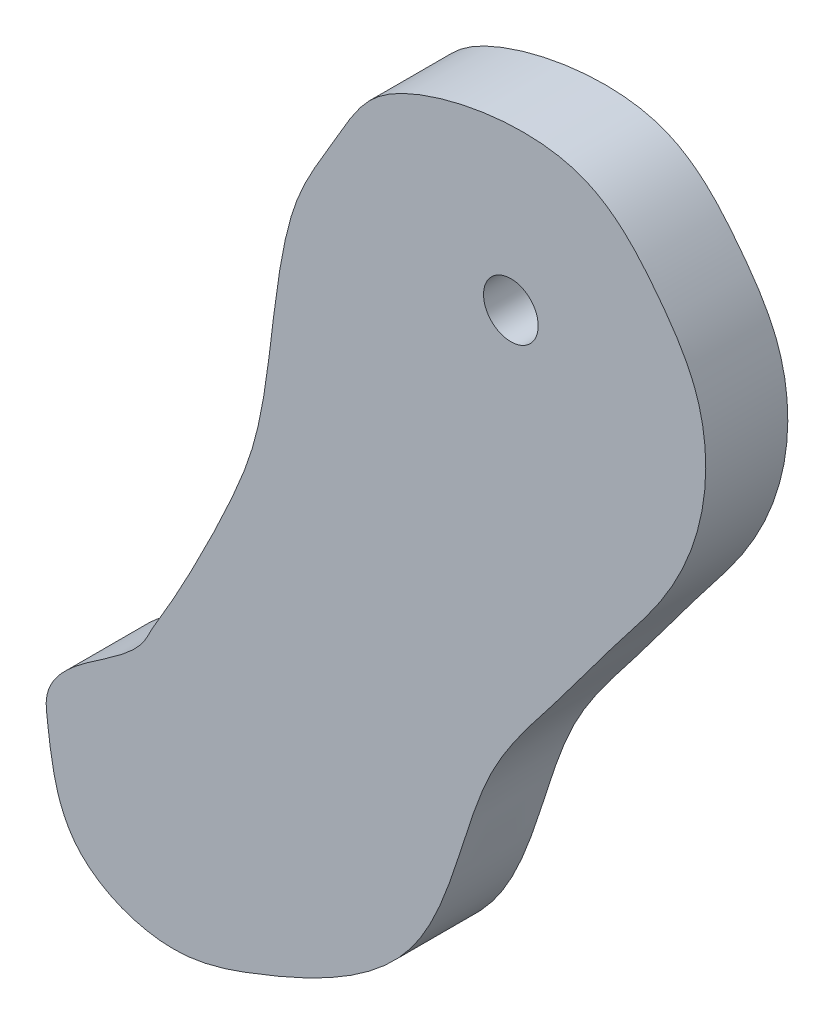
ISO-10303-21;
HEADER;
FILE_DESCRIPTION(('STEP AP214'),'2;1');
FILE_NAME('part.step','',(''),(''),'','','');
FILE_SCHEMA(('AUTOMOTIVE_DESIGN { 1 0 10303 214 1 1 1 1 }'));
ENDSEC;
DATA;
#1=APPLICATION_CONTEXT('core data for automotive mechanical design processes');
#2=APPLICATION_PROTOCOL_DEFINITION('international standard','automotive_design',2000,#1);
#3=PRODUCT_CONTEXT('',#1,'mechanical');
#4=PRODUCT('Part','Part','',(#3));
#5=PRODUCT_RELATED_PRODUCT_CATEGORY('part','',(#4));
#6=PRODUCT_DEFINITION_FORMATION('','',#4);
#7=PRODUCT_DEFINITION_CONTEXT('part definition',#1,'design');
#8=PRODUCT_DEFINITION('design','',#6,#7);
#9=PRODUCT_DEFINITION_SHAPE('','',#8);
#10=(LENGTH_UNIT() NAMED_UNIT(*) SI_UNIT(.MILLI.,.METRE.));
#11=(NAMED_UNIT(*) PLANE_ANGLE_UNIT() SI_UNIT($,.RADIAN.));
#12=(NAMED_UNIT(*) SI_UNIT($,.STERADIAN.) SOLID_ANGLE_UNIT());
#13=UNCERTAINTY_MEASURE_WITH_UNIT(LENGTH_MEASURE(1.E-05),#10,'distance_accuracy_value','');
#14=(GEOMETRIC_REPRESENTATION_CONTEXT(3) GLOBAL_UNCERTAINTY_ASSIGNED_CONTEXT((#13)) GLOBAL_UNIT_ASSIGNED_CONTEXT((#10,
#11,#12)) REPRESENTATION_CONTEXT('',''));
#15=CARTESIAN_POINT('',(0.,0.,0.));
#16=DIRECTION('',(0.,0.,1.));
#17=DIRECTION('',(1.,0.,0.));
#18=AXIS2_PLACEMENT_3D('',#15,#16,#17);
#19=CARTESIAN_POINT('',(-13.9187579635498,-4.98327703315374,3.));
#20=CARTESIAN_POINT('',(-13.8913839542716,-3.85610857471606,3.));
#21=CARTESIAN_POINT('',(-10.5195286882443,-1.84720762742832,3.));
#22=CARTESIAN_POINT('',(-10.1595241499511,-0.739910558036557,3.));
#23=CARTESIAN_POINT('',(-9.27298416828187,0.450357546495944,3.));
#24=CARTESIAN_POINT('',(-6.60460595874179,5.86872059642833,3.));
#25=CARTESIAN_POINT('',(-5.86434099670478,8.43527780771908,3.));
#26=CARTESIAN_POINT('',(-5.26305396048236,14.9937334901543,3.));
#27=CARTESIAN_POINT('',(-2.88813848215597,18.8302397059523,3.));
#28=CARTESIAN_POINT('',(-1.95605752544011,21.0713879921337,3.));
#29=CARTESIAN_POINT('',(5.39292609840897,22.6268629511655,3.));
#30=CARTESIAN_POINT('',(8.27010881393388,19.4445422402987,3.));
#31=CARTESIAN_POINT('',(10.1887589331951,16.6288293820978,3.));
#32=CARTESIAN_POINT('',(10.3460989172217,13.0123883856087,3.));
#33=CARTESIAN_POINT('',(8.93698439335931,9.78869835523108,3.));
#34=CARTESIAN_POINT('',(6.75344503672636,7.13072751511924,3.));
#35=CARTESIAN_POINT('',(4.74899392645413,4.31130847135723,3.));
#36=CARTESIAN_POINT('',(2.04591962898475,1.08453649628744,3.));
#37=CARTESIAN_POINT('',(1.13601821784208,-2.79384029872061,3.));
#38=CARTESIAN_POINT('',(-0.883041283386666,-7.3396050476453,3.));
#39=CARTESIAN_POINT('',(-5.11326568406489,-9.39072479428553,3.));
#40=CARTESIAN_POINT('',(-9.48272686637992,-10.8852616054775,3.));
#41=CARTESIAN_POINT('',(-13.4150806657355,-9.3477618856312,3.));
#42=CARTESIAN_POINT('',(-13.7549527056015,-6.54607838011544,3.));
#43=CARTESIAN_POINT('',(-13.9221054390931,-5.1211146735764,3.));
#44=CARTESIAN_POINT('',(-13.9187579635498,-4.98327703315374,3.));
#45=B_SPLINE_CURVE_WITH_KNOTS('',3,(#19,#20,#21,#22,#23,#24,#25,#26,#27,#28,#29,#30,#31,#32,#33,
#34,#35,#36,#37,#38,#39,#40,#41,#42,#43,#44),.UNSPECIFIED.,.T.,.F.,(4,1,1,1,1,1,1,1,1,1,1,1,1,1,
1,1,1,1,1,1,1,1,1,4),(0.,0.0388920203203432,0.0957910713786864,0.170637324850251,
0.206387983363971,0.248875394756016,0.278358672407214,0.297921345713307,0.348786261929981,
0.419462087152307,0.462880556637251,0.494962177423828,0.536060755971546,0.581869624844249,
0.614364109209545,0.655354426578634,0.702626505741707,0.758040334594742,0.792049077363629,
0.87188756118118,0.908934810693921,0.952440256182676,0.995244025618268,1.),.UNSPECIFIED.);
#46=DIRECTION('',(0.,0.,-1.));
#47=VECTOR('',#46,1.);
#48=SURFACE_OF_LINEAR_EXTRUSION('',#45,#47);
#49=CARTESIAN_POINT('',(-13.9187579635498,-4.98327703315374,3.));
#50=VERTEX_POINT('',#49);
#51=EDGE_CURVE('E45',#50,#50,#45,.T.);
#52=ORIENTED_EDGE('',*,*,#51,.T.);
#53=EDGE_LOOP('',(#52));
#54=FACE_BOUND('',#53,.T.);
#55=CARTESIAN_POINT('',(-13.9187579635498,-4.98327703315374,0.));
#56=CARTESIAN_POINT('',(-13.8913839542716,-3.85610857471606,0.));
#57=CARTESIAN_POINT('',(-10.5195286882443,-1.84720762742832,0.));
#58=CARTESIAN_POINT('',(-10.1595241499511,-0.739910558036557,0.));
#59=CARTESIAN_POINT('',(-9.27298416828187,0.450357546495944,0.));
#60=CARTESIAN_POINT('',(-6.60460595874179,5.86872059642833,0.));
#61=CARTESIAN_POINT('',(-5.86434099670478,8.43527780771908,0.));
#62=CARTESIAN_POINT('',(-5.26305396048236,14.9937334901543,0.));
#63=CARTESIAN_POINT('',(-2.88813848215597,18.8302397059523,0.));
#64=CARTESIAN_POINT('',(-1.95605752544011,21.0713879921337,0.));
#65=CARTESIAN_POINT('',(5.39292609840897,22.6268629511655,0.));
#66=CARTESIAN_POINT('',(8.27010881393388,19.4445422402987,0.));
#67=CARTESIAN_POINT('',(10.1887589331951,16.6288293820978,0.));
#68=CARTESIAN_POINT('',(10.3460989172217,13.0123883856087,0.));
#69=CARTESIAN_POINT('',(8.93698439335931,9.78869835523108,0.));
#70=CARTESIAN_POINT('',(6.75344503672636,7.13072751511924,0.));
#71=CARTESIAN_POINT('',(4.74899392645413,4.31130847135723,0.));
#72=CARTESIAN_POINT('',(2.04591962898475,1.08453649628744,0.));
#73=CARTESIAN_POINT('',(1.13601821784208,-2.79384029872061,0.));
#74=CARTESIAN_POINT('',(-0.883041283386666,-7.3396050476453,0.));
#75=CARTESIAN_POINT('',(-5.11326568406489,-9.39072479428553,0.));
#76=CARTESIAN_POINT('',(-9.48272686637992,-10.8852616054775,0.));
#77=CARTESIAN_POINT('',(-13.4150806657355,-9.3477618856312,0.));
#78=CARTESIAN_POINT('',(-13.7549527056015,-6.54607838011544,0.));
#79=CARTESIAN_POINT('',(-13.9221054390931,-5.1211146735764,0.));
#80=CARTESIAN_POINT('',(-13.9187579635498,-4.98327703315374,0.));
#81=B_SPLINE_CURVE_WITH_KNOTS('',3,(#55,#56,#57,#58,#59,#60,#61,#62,#63,#64,#65,#66,#67,#68,#69,
#70,#71,#72,#73,#74,#75,#76,#77,#78,#79,#80),.UNSPECIFIED.,.T.,.F.,(4,1,1,1,1,1,1,1,1,1,1,1,1,1,
1,1,1,1,1,1,1,1,1,4),(0.,0.0388920203203432,0.0957910713786864,0.170637324850251,
0.206387983363971,0.248875394756016,0.278358672407214,0.297921345713307,0.348786261929981,
0.419462087152307,0.462880556637251,0.494962177423828,0.536060755971546,0.581869624844249,
0.614364109209545,0.655354426578634,0.702626505741707,0.758040334594742,0.792049077363629,
0.87188756118118,0.908934810693921,0.952440256182676,0.995244025618268,1.),.UNSPECIFIED.);
#82=CARTESIAN_POINT('',(-13.9187579635498,-4.98327703315374,0.));
#83=VERTEX_POINT('',#82);
#84=EDGE_CURVE('E56',#83,#83,#81,.T.);
#85=ORIENTED_EDGE('',*,*,#84,.F.);
#86=EDGE_LOOP('',(#85));
#87=FACE_BOUND('',#86,.T.);
#88=ADVANCED_FACE('F34',(#54,#87),#48,.T.);
#89=CARTESIAN_POINT('',(3.07143542215546,15.9425726691493,3.));
#90=DIRECTION('',(0.,0.,-1.));
#91=DIRECTION('',(-1.,0.,0.));
#92=AXIS2_PLACEMENT_3D('',#89,#90,#91);
#93=CYLINDRICAL_SURFACE('',#92,1.);
#94=CARTESIAN_POINT('',(3.07143542215546,15.9425726691493,3.));
#95=DIRECTION('',(0.,0.,1.));
#96=DIRECTION('',(1.,0.,0.));
#97=AXIS2_PLACEMENT_3D('',#94,#95,#96);
#98=CIRCLE('',#97,1.);
#99=CARTESIAN_POINT('',(4.07143542215546,15.9425726691493,3.));
#100=VERTEX_POINT('',#99);
#101=EDGE_CURVE('E41',#100,#100,#98,.T.);
#102=ORIENTED_EDGE('',*,*,#101,.T.);
#103=EDGE_LOOP('',(#102));
#104=FACE_BOUND('',#103,.T.);
#105=CARTESIAN_POINT('',(3.07143542215546,15.9425726691493,0.));
#106=DIRECTION('',(0.,0.,1.));
#107=DIRECTION('',(1.,0.,0.));
#108=AXIS2_PLACEMENT_3D('',#105,#106,#107);
#109=CIRCLE('',#108,1.);
#110=CARTESIAN_POINT('',(4.07143542215546,15.9425726691493,0.));
#111=VERTEX_POINT('',#110);
#112=EDGE_CURVE('E50',#111,#111,#109,.T.);
#113=ORIENTED_EDGE('',*,*,#112,.F.);
#114=EDGE_LOOP('',(#113));
#115=FACE_BOUND('',#114,.T.);
#116=ADVANCED_FACE('F69',(#104,#115),#93,.F.);
#117=CARTESIAN_POINT('',(0.,0.,3.));
#118=DIRECTION('',(0.,0.,1.));
#119=DIRECTION('',(1.,0.,0.));
#120=AXIS2_PLACEMENT_3D('',#117,#118,#119);
#121=PLANE('',#120);
#122=ORIENTED_EDGE('',*,*,#51,.F.);
#123=EDGE_LOOP('',(#122));
#124=FACE_BOUND('',#123,.T.);
#125=ORIENTED_EDGE('',*,*,#101,.F.);
#126=EDGE_LOOP('',(#125));
#127=FACE_BOUND('',#126,.T.);
#128=ADVANCED_FACE('F71',(#124,#127),#121,.T.);
#129=CARTESIAN_POINT('',(0.,0.,0.));
#130=DIRECTION('',(0.,0.,1.));
#131=DIRECTION('',(1.,0.,0.));
#132=AXIS2_PLACEMENT_3D('',#129,#130,#131);
#133=PLANE('',#132);
#134=CARTESIAN_POINT('',(-10.3025451548549,-6.51016707603581,0.));
#135=DIRECTION('',(0.,0.,1.));
#136=DIRECTION('',(1.,0.,0.));
#137=AXIS2_PLACEMENT_3D('',#134,#135,#136);
#138=CIRCLE('',#137,1.);
#139=CARTESIAN_POINT('',(-9.30254515485492,-6.51016707603581,0.));
#140=VERTEX_POINT('',#139);
#141=EDGE_CURVE('E10',#140,#140,#138,.F.);
#142=ORIENTED_EDGE('',*,*,#141,.F.);
#143=EDGE_LOOP('',(#142));
#144=FACE_BOUND('',#143,.T.);
#145=ORIENTED_EDGE('',*,*,#84,.T.);
#146=EDGE_LOOP('',(#145));
#147=FACE_BOUND('',#146,.T.);
#148=ORIENTED_EDGE('',*,*,#112,.T.);
#149=EDGE_LOOP('',(#148));
#150=FACE_BOUND('',#149,.T.);
#151=ADVANCED_FACE('F67',(#144,#147,#150),#133,.F.);
#152=CARTESIAN_POINT('',(-10.3025451548549,-6.51016707603581,-3.));
#153=DIRECTION('',(0.,0.,1.));
#154=DIRECTION('',(1.,0.,0.));
#155=AXIS2_PLACEMENT_3D('',#152,#153,#154);
#156=CYLINDRICAL_SURFACE('',#155,1.);
#157=CARTESIAN_POINT('',(-10.3025451548549,-6.51016707603581,-3.));
#158=DIRECTION('',(0.,0.,-1.));
#159=DIRECTION('',(-1.,0.,0.));
#160=AXIS2_PLACEMENT_3D('',#157,#158,#159);
#161=CIRCLE('',#160,1.);
#162=CARTESIAN_POINT('',(-11.3025451548549,-6.51016707603581,-3.));
#163=VERTEX_POINT('',#162);
#164=EDGE_CURVE('E60',#163,#163,#161,.T.);
#165=ORIENTED_EDGE('',*,*,#164,.F.);
#166=EDGE_LOOP('',(#165));
#167=FACE_BOUND('',#166,.T.);
#168=ORIENTED_EDGE('',*,*,#141,.T.);
#169=EDGE_LOOP('',(#168));
#170=FACE_BOUND('',#169,.T.);
#171=ADVANCED_FACE('F81',(#167,#170),#156,.T.);
#172=CARTESIAN_POINT('',(-10.3025451548549,-6.51016707603581,-3.));
#173=DIRECTION('',(0.,0.,-1.));
#174=DIRECTION('',(-1.,0.,0.));
#175=AXIS2_PLACEMENT_3D('',#172,#173,#174);
#176=PLANE('',#175);
#177=ORIENTED_EDGE('',*,*,#164,.T.);
#178=EDGE_LOOP('',(#177));
#179=FACE_BOUND('',#178,.T.);
#180=ADVANCED_FACE('F86',(#179),#176,.T.);
#181=CLOSED_SHELL('',(#88,#116,#128,#151,#171,#180));
#182=MANIFOLD_SOLID_BREP('B2',#181);
#183=ADVANCED_BREP_SHAPE_REPRESENTATION('',(#18,#182),#14);
#184=SHAPE_DEFINITION_REPRESENTATION(#9,#183);
ENDSEC;
END-ISO-10303-21;
